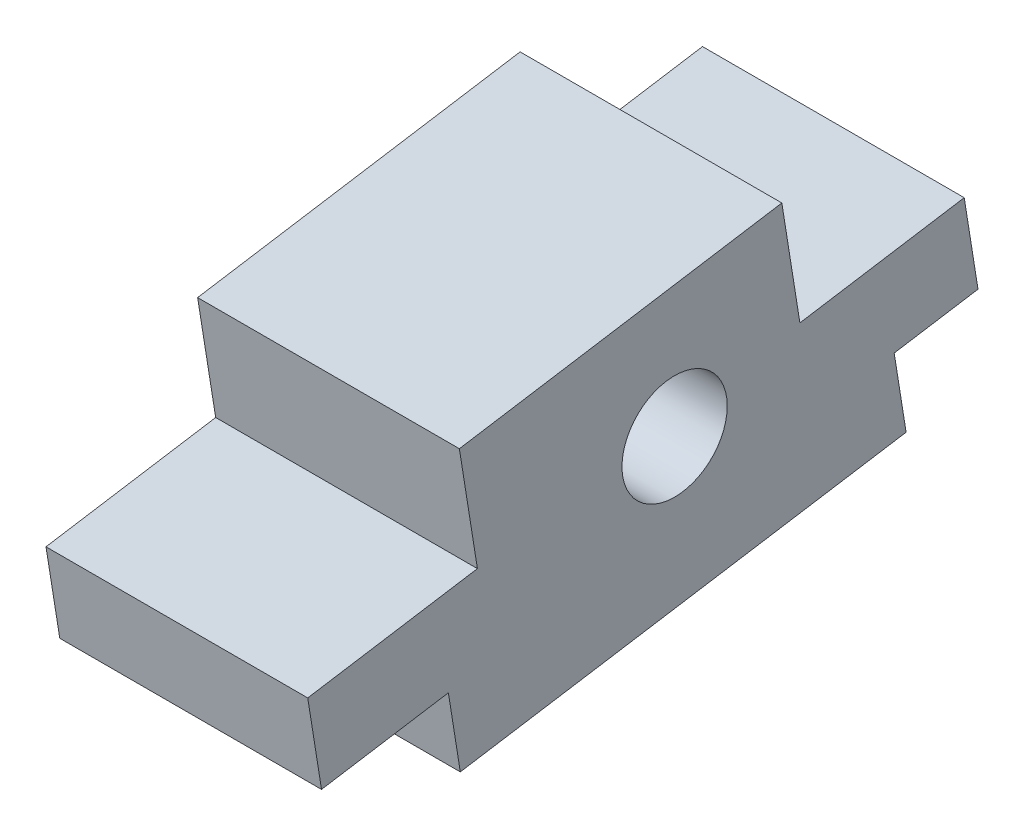
ISO-10303-21;
HEADER;
FILE_DESCRIPTION(('STEP AP214'),'2;1');
FILE_NAME('part.step','',(''),(''),'','','');
FILE_SCHEMA(('AUTOMOTIVE_DESIGN { 1 0 10303 214 1 1 1 1 }'));
ENDSEC;
DATA;
#1=APPLICATION_CONTEXT('core data for automotive mechanical design processes');
#2=APPLICATION_PROTOCOL_DEFINITION('international standard','automotive_design',2000,#1);
#3=PRODUCT_CONTEXT('',#1,'mechanical');
#4=PRODUCT('Part','Part','',(#3));
#5=PRODUCT_RELATED_PRODUCT_CATEGORY('part','',(#4));
#6=PRODUCT_DEFINITION_FORMATION('','',#4);
#7=PRODUCT_DEFINITION_CONTEXT('part definition',#1,'design');
#8=PRODUCT_DEFINITION('design','',#6,#7);
#9=PRODUCT_DEFINITION_SHAPE('','',#8);
#10=(LENGTH_UNIT() NAMED_UNIT(*) SI_UNIT(.MILLI.,.METRE.));
#11=(NAMED_UNIT(*) PLANE_ANGLE_UNIT() SI_UNIT($,.RADIAN.));
#12=(NAMED_UNIT(*) SI_UNIT($,.STERADIAN.) SOLID_ANGLE_UNIT());
#13=UNCERTAINTY_MEASURE_WITH_UNIT(LENGTH_MEASURE(1.E-05),#10,'distance_accuracy_value','');
#14=(GEOMETRIC_REPRESENTATION_CONTEXT(3) GLOBAL_UNCERTAINTY_ASSIGNED_CONTEXT((#13)) GLOBAL_UNIT_ASSIGNED_CONTEXT((#10,
#11,#12)) REPRESENTATION_CONTEXT('',''));
#15=CARTESIAN_POINT('',(0.,0.,0.));
#16=DIRECTION('',(0.,0.,1.));
#17=DIRECTION('',(1.,0.,0.));
#18=AXIS2_PLACEMENT_3D('',#15,#16,#17);
#19=CARTESIAN_POINT('',(30.,0.,0.));
#20=DIRECTION('',(-1.,0.,0.));
#21=DIRECTION('',(0.,0.,1.));
#22=AXIS2_PLACEMENT_3D('',#19,#20,#21);
#23=PLANE('',#22);
#24=DIRECTION('',(0.,0.157884428051549,-0.987457597762474));
#25=VECTOR('',#24,1.);
#26=CARTESIAN_POINT('',(30.,-12.4833012393773,25.9308376280646));
#27=LINE('',#26,#25);
#28=CARTESIAN_POINT('',(30.,-14.8081494424364,40.471150755117));
#29=VERTEX_POINT('',#28);
#30=CARTESIAN_POINT('',(30.,-12.4833012393773,25.9308376280646));
#31=VERTEX_POINT('',#30);
#32=EDGE_CURVE('E204',#29,#31,#27,.T.);
#33=ORIENTED_EDGE('',*,*,#32,.T.);
#34=DIRECTION('',(0.,-0.987457597762473,-0.15788442805155));
#35=VECTOR('',#34,1.);
#36=CARTESIAN_POINT('',(30.,-21.022754011026,24.5654659708106));
#37=LINE('',#36,#35);
#38=CARTESIAN_POINT('',(30.,-21.022754011026,24.5654659708106));
#39=VERTEX_POINT('',#38);
#40=EDGE_CURVE('E116',#31,#39,#37,.T.);
#41=ORIENTED_EDGE('',*,*,#40,.T.);
#42=DIRECTION('',(0.,0.15788442805155,-0.987457597762474));
#43=VECTOR('',#42,1.);
#44=CARTESIAN_POINT('',(30.,-12.8526712661271,-26.532735291726));
#45=LINE('',#44,#43);
#46=CARTESIAN_POINT('',(30.,-12.8526712661271,-26.532735291726));
#47=VERTEX_POINT('',#46);
#48=EDGE_CURVE('E241',#39,#47,#45,.T.);
#49=ORIENTED_EDGE('',*,*,#48,.T.);
#50=DIRECTION('',(0.,0.987457597762474,0.157884428051547));
#51=VECTOR('',#50,1.);
#52=CARTESIAN_POINT('',(30.,-4.3132184944783,-25.167363634472));
#53=LINE('',#52,#51);
#54=CARTESIAN_POINT('',(30.,-4.3132184944783,-25.167363634472));
#55=VERTEX_POINT('',#54);
#56=EDGE_CURVE('E261',#47,#55,#53,.T.);
#57=ORIENTED_EDGE('',*,*,#56,.T.);
#58=DIRECTION('',(0.,0.157884428051547,-0.987457597762474));
#59=VECTOR('',#58,1.);
#60=CARTESIAN_POINT('',(30.,-2.77735602490824,-34.7731181943837));
#61=LINE('',#60,#59);
#62=CARTESIAN_POINT('',(30.,-2.77735602490824,-34.7731181943837));
#63=VERTEX_POINT('',#62);
#64=EDGE_CURVE('E257',#55,#63,#61,.T.);
#65=ORIENTED_EDGE('',*,*,#64,.T.);
#66=DIRECTION('',(0.,0.987457597762474,0.157884428051547));
#67=VECTOR('',#66,1.);
#68=CARTESIAN_POINT('',(30.,7.0972199527165,-33.1942739138682));
#69=LINE('',#68,#67);
#70=CARTESIAN_POINT('',(30.,7.0972199527165,-33.1942739138682));
#71=VERTEX_POINT('',#70);
#72=EDGE_CURVE('E260',#63,#71,#69,.T.);
#73=ORIENTED_EDGE('',*,*,#72,.T.);
#74=DIRECTION('',(0.,-0.157884428051548,0.987457597762474));
#75=VECTOR('',#74,1.);
#76=CARTESIAN_POINT('',(30.,4.08569762502307,-14.3592903755214));
#77=LINE('',#76,#75);
#78=CARTESIAN_POINT('',(30.,4.08569762502307,-14.3592903755214));
#79=VERTEX_POINT('',#78);
#80=EDGE_CURVE('E265',#71,#79,#77,.T.);
#81=ORIENTED_EDGE('',*,*,#80,.T.);
#82=DIRECTION('',(0.,0.987457597762474,0.157884428051546));
#83=VECTOR('',#82,1.);
#84=CARTESIAN_POINT('',(30.,17.023447604708,-12.2906757226543));
#85=LINE('',#84,#83);
#86=CARTESIAN_POINT('',(30.,17.023447604708,-12.2906757226543));
#87=VERTEX_POINT('',#86);
#88=EDGE_CURVE('E272',#79,#87,#85,.T.);
#89=ORIENTED_EDGE('',*,*,#88,.T.);
#90=DIRECTION('',(0.,-0.157884428051548,0.987457597762474));
#91=VECTOR('',#90,1.);
#92=CARTESIAN_POINT('',(30.,11.1135891865311,24.6713899398569));
#93=LINE('',#92,#91);
#94=CARTESIAN_POINT('',(30.,11.1135891865311,24.6713899398569));
#95=VERTEX_POINT('',#94);
#96=EDGE_CURVE('E147',#87,#95,#93,.T.);
#97=ORIENTED_EDGE('',*,*,#96,.T.);
#98=DIRECTION('',(0.,-0.987457597762474,-0.157884428051549));
#99=VECTOR('',#98,1.);
#100=CARTESIAN_POINT('',(30.,-1.824160793154,22.6027752869897));
#101=LINE('',#100,#99);
#102=CARTESIAN_POINT('',(30.,-1.824160793154,22.6027752869897));
#103=VERTEX_POINT('',#102);
#104=EDGE_CURVE('E141',#95,#103,#101,.T.);
#105=ORIENTED_EDGE('',*,*,#104,.T.);
#106=DIRECTION('',(0.,-0.157884428051548,0.987457597762474));
#107=VECTOR('',#106,1.);
#108=CARTESIAN_POINT('',(30.,-4.93357346481162,42.0499950356325));
#109=LINE('',#108,#107);
#110=CARTESIAN_POINT('',(30.,-4.93357346481162,42.0499950356325));
#111=VERTEX_POINT('',#110);
#112=EDGE_CURVE('E145',#103,#111,#109,.T.);
#113=ORIENTED_EDGE('',*,*,#112,.T.);
#114=DIRECTION('',(0.,-0.987457597762474,-0.157884428051547));
#115=VECTOR('',#114,1.);
#116=CARTESIAN_POINT('',(30.,-14.8081494424364,40.471150755117));
#117=LINE('',#116,#115);
#118=EDGE_CURVE('E61',#111,#29,#117,.T.);
#119=ORIENTED_EDGE('',*,*,#118,.T.);
#120=EDGE_LOOP('',(#33,#41,#49,#57,#65,#73,#81,#89,#97,#105,#113,#119));
#121=FACE_BOUND('',#120,.T.);
#122=CARTESIAN_POINT('',(30.,0.,0.));
#123=DIRECTION('',(1.,0.,0.));
#124=DIRECTION('',(0.,0.,-1.));
#125=AXIS2_PLACEMENT_3D('',#122,#123,#124);
#126=CIRCLE('',#125,6.03249999999993);
#127=CARTESIAN_POINT('',(30.,0.,-6.03249999999993));
#128=VERTEX_POINT('',#127);
#129=EDGE_CURVE('E174',#128,#128,#126,.T.);
#130=ORIENTED_EDGE('',*,*,#129,.F.);
#131=EDGE_LOOP('',(#130));
#132=FACE_BOUND('',#131,.T.);
#133=ADVANCED_FACE('F43',(#121,#132),#23,.F.);
#134=CARTESIAN_POINT('',(0.,0.,0.));
#135=DIRECTION('',(-1.,0.,0.));
#136=DIRECTION('',(0.,0.,1.));
#137=AXIS2_PLACEMENT_3D('',#134,#135,#136);
#138=PLANE('',#137);
#139=DIRECTION('',(0.,0.157884428051549,-0.987457597762474));
#140=VECTOR('',#139,1.);
#141=CARTESIAN_POINT('',(0.,-12.4833012393773,25.9308376280646));
#142=LINE('',#141,#140);
#143=CARTESIAN_POINT('',(0.,-14.8081494424364,40.471150755117));
#144=VERTEX_POINT('',#143);
#145=CARTESIAN_POINT('',(0.,-12.4833012393773,25.9308376280646));
#146=VERTEX_POINT('',#145);
#147=EDGE_CURVE('E169',#144,#146,#142,.T.);
#148=ORIENTED_EDGE('',*,*,#147,.F.);
#149=DIRECTION('',(0.,-0.987457597762474,-0.157884428051547));
#150=VECTOR('',#149,1.);
#151=CARTESIAN_POINT('',(0.,-14.8081494424364,40.471150755117));
#152=LINE('',#151,#150);
#153=CARTESIAN_POINT('',(0.,-4.93357346481162,42.0499950356325));
#154=VERTEX_POINT('',#153);
#155=EDGE_CURVE('E108',#154,#144,#152,.T.);
#156=ORIENTED_EDGE('',*,*,#155,.F.);
#157=DIRECTION('',(0.,-0.157884428051548,0.987457597762474));
#158=VECTOR('',#157,1.);
#159=CARTESIAN_POINT('',(0.,-4.93357346481162,42.0499950356325));
#160=LINE('',#159,#158);
#161=CARTESIAN_POINT('',(0.,-1.824160793154,22.6027752869897));
#162=VERTEX_POINT('',#161);
#163=EDGE_CURVE('E102',#162,#154,#160,.T.);
#164=ORIENTED_EDGE('',*,*,#163,.F.);
#165=DIRECTION('',(0.,-0.987457597762474,-0.157884428051549));
#166=VECTOR('',#165,1.);
#167=CARTESIAN_POINT('',(0.,-1.824160793154,22.6027752869897));
#168=LINE('',#167,#166);
#169=CARTESIAN_POINT('',(0.,11.1135891865311,24.6713899398569));
#170=VERTEX_POINT('',#169);
#171=EDGE_CURVE('E156',#170,#162,#168,.T.);
#172=ORIENTED_EDGE('',*,*,#171,.F.);
#173=DIRECTION('',(0.,-0.157884428051548,0.987457597762474));
#174=VECTOR('',#173,1.);
#175=CARTESIAN_POINT('',(0.,11.1135891865311,24.6713899398569));
#176=LINE('',#175,#174);
#177=CARTESIAN_POINT('',(0.,17.023447604708,-12.2906757226543));
#178=VERTEX_POINT('',#177);
#179=EDGE_CURVE('E195',#178,#170,#176,.T.);
#180=ORIENTED_EDGE('',*,*,#179,.F.);
#181=DIRECTION('',(0.,0.987457597762474,0.157884428051546));
#182=VECTOR('',#181,1.);
#183=CARTESIAN_POINT('',(0.,17.023447604708,-12.2906757226543));
#184=LINE('',#183,#182);
#185=CARTESIAN_POINT('',(0.,4.08569762502307,-14.3592903755214));
#186=VERTEX_POINT('',#185);
#187=EDGE_CURVE('E192',#186,#178,#184,.T.);
#188=ORIENTED_EDGE('',*,*,#187,.F.);
#189=DIRECTION('',(0.,-0.157884428051548,0.987457597762474));
#190=VECTOR('',#189,1.);
#191=CARTESIAN_POINT('',(0.,4.08569762502307,-14.3592903755214));
#192=LINE('',#191,#190);
#193=CARTESIAN_POINT('',(0.,7.0972199527165,-33.1942739138682));
#194=VERTEX_POINT('',#193);
#195=EDGE_CURVE('E189',#194,#186,#192,.T.);
#196=ORIENTED_EDGE('',*,*,#195,.F.);
#197=DIRECTION('',(0.,0.987457597762474,0.157884428051547));
#198=VECTOR('',#197,1.);
#199=CARTESIAN_POINT('',(0.,7.0972199527165,-33.1942739138682));
#200=LINE('',#199,#198);
#201=CARTESIAN_POINT('',(0.,-2.77735602490824,-34.7731181943837));
#202=VERTEX_POINT('',#201);
#203=EDGE_CURVE('E186',#202,#194,#200,.T.);
#204=ORIENTED_EDGE('',*,*,#203,.F.);
#205=DIRECTION('',(0.,0.157884428051547,-0.987457597762474));
#206=VECTOR('',#205,1.);
#207=CARTESIAN_POINT('',(0.,-2.77735602490824,-34.7731181943837));
#208=LINE('',#207,#206);
#209=CARTESIAN_POINT('',(0.,-4.3132184944783,-25.167363634472));
#210=VERTEX_POINT('',#209);
#211=EDGE_CURVE('E183',#210,#202,#208,.T.);
#212=ORIENTED_EDGE('',*,*,#211,.F.);
#213=DIRECTION('',(0.,0.987457597762474,0.157884428051547));
#214=VECTOR('',#213,1.);
#215=CARTESIAN_POINT('',(0.,-4.3132184944783,-25.167363634472));
#216=LINE('',#215,#214);
#217=CARTESIAN_POINT('',(0.,-12.8526712661271,-26.532735291726));
#218=VERTEX_POINT('',#217);
#219=EDGE_CURVE('E180',#218,#210,#216,.T.);
#220=ORIENTED_EDGE('',*,*,#219,.F.);
#221=DIRECTION('',(0.,0.15788442805155,-0.987457597762474));
#222=VECTOR('',#221,1.);
#223=CARTESIAN_POINT('',(0.,-12.8526712661271,-26.532735291726));
#224=LINE('',#223,#222);
#225=CARTESIAN_POINT('',(0.,-21.022754011026,24.5654659708106));
#226=VERTEX_POINT('',#225);
#227=EDGE_CURVE('E177',#226,#218,#224,.T.);
#228=ORIENTED_EDGE('',*,*,#227,.F.);
#229=DIRECTION('',(0.,-0.987457597762473,-0.15788442805155));
#230=VECTOR('',#229,1.);
#231=CARTESIAN_POINT('',(0.,-21.022754011026,24.5654659708106));
#232=LINE('',#231,#230);
#233=EDGE_CURVE('E173',#146,#226,#232,.T.);
#234=ORIENTED_EDGE('',*,*,#233,.F.);
#235=EDGE_LOOP('',(#148,#156,#164,#172,#180,#188,#196,#204,#212,#220,#228,#234));
#236=FACE_BOUND('',#235,.T.);
#237=CARTESIAN_POINT('',(0.,0.,0.));
#238=DIRECTION('',(1.,0.,0.));
#239=DIRECTION('',(0.,0.,-1.));
#240=AXIS2_PLACEMENT_3D('',#237,#238,#239);
#241=CIRCLE('',#240,6.03249999999993);
#242=CARTESIAN_POINT('',(0.,0.,-6.03249999999993));
#243=VERTEX_POINT('',#242);
#244=EDGE_CURVE('E451',#243,#243,#241,.T.);
#245=ORIENTED_EDGE('',*,*,#244,.T.);
#246=EDGE_LOOP('',(#245));
#247=FACE_BOUND('',#246,.T.);
#248=ADVANCED_FACE('F245',(#236,#247),#138,.T.);
#249=CARTESIAN_POINT('',(30.,-12.4833012393773,25.9308376280646));
#250=DIRECTION('',(0.,0.987457597762474,0.157884428051549));
#251=DIRECTION('',(0.,-0.157884428051549,0.987457597762474));
#252=AXIS2_PLACEMENT_3D('',#249,#250,#251);
#253=PLANE('',#252);
#254=ORIENTED_EDGE('',*,*,#147,.T.);
#255=DIRECTION('',(-1.,0.,0.));
#256=VECTOR('',#255,1.);
#257=CARTESIAN_POINT('',(30.,-12.4833012393773,25.9308376280646));
#258=LINE('',#257,#256);
#259=EDGE_CURVE('E11',#31,#146,#258,.T.);
#260=ORIENTED_EDGE('',*,*,#259,.F.);
#261=ORIENTED_EDGE('',*,*,#32,.F.);
#262=DIRECTION('',(-1.,0.,0.));
#263=VECTOR('',#262,1.);
#264=CARTESIAN_POINT('',(30.,-14.8081494424364,40.471150755117));
#265=LINE('',#264,#263);
#266=EDGE_CURVE('E165',#29,#144,#265,.T.);
#267=ORIENTED_EDGE('',*,*,#266,.T.);
#268=EDGE_LOOP('',(#254,#260,#261,#267));
#269=FACE_BOUND('',#268,.T.);
#270=ADVANCED_FACE('F45',(#269),#253,.F.);
#271=CARTESIAN_POINT('',(30.,-21.022754011026,24.5654659708106));
#272=DIRECTION('',(0.,0.15788442805155,-0.987457597762473));
#273=DIRECTION('',(0.,0.987457597762474,0.15788442805155));
#274=AXIS2_PLACEMENT_3D('',#271,#272,#273);
#275=PLANE('',#274);
#276=ORIENTED_EDGE('',*,*,#233,.T.);
#277=DIRECTION('',(-1.,0.,0.));
#278=VECTOR('',#277,1.);
#279=CARTESIAN_POINT('',(30.,-21.022754011026,24.5654659708106));
#280=LINE('',#279,#278);
#281=EDGE_CURVE('E53',#39,#226,#280,.T.);
#282=ORIENTED_EDGE('',*,*,#281,.F.);
#283=ORIENTED_EDGE('',*,*,#40,.F.);
#284=ORIENTED_EDGE('',*,*,#259,.T.);
#285=EDGE_LOOP('',(#276,#282,#283,#284));
#286=FACE_BOUND('',#285,.T.);
#287=ADVANCED_FACE('F308',(#286),#275,.F.);
#288=CARTESIAN_POINT('',(30.,-12.8526712661271,-26.532735291726));
#289=DIRECTION('',(0.,0.987457597762474,0.15788442805155));
#290=DIRECTION('',(0.,-0.15788442805155,0.987457597762474));
#291=AXIS2_PLACEMENT_3D('',#288,#289,#290);
#292=PLANE('',#291);
#293=ORIENTED_EDGE('',*,*,#227,.T.);
#294=DIRECTION('',(-1.,0.,0.));
#295=VECTOR('',#294,1.);
#296=CARTESIAN_POINT('',(30.,-12.8526712661271,-26.532735291726));
#297=LINE('',#296,#295);
#298=EDGE_CURVE('E231',#47,#218,#297,.T.);
#299=ORIENTED_EDGE('',*,*,#298,.F.);
#300=ORIENTED_EDGE('',*,*,#48,.F.);
#301=ORIENTED_EDGE('',*,*,#281,.T.);
#302=EDGE_LOOP('',(#293,#299,#300,#301));
#303=FACE_BOUND('',#302,.T.);
#304=ADVANCED_FACE('F239',(#303),#292,.F.);
#305=CARTESIAN_POINT('',(30.,-4.3132184944783,-25.167363634472));
#306=DIRECTION('',(0.,-0.157884428051547,0.987457597762474));
#307=DIRECTION('',(0.,-0.987457597762474,-0.157884428051547));
#308=AXIS2_PLACEMENT_3D('',#305,#306,#307);
#309=PLANE('',#308);
#310=ORIENTED_EDGE('',*,*,#219,.T.);
#311=DIRECTION('',(-1.,0.,0.));
#312=VECTOR('',#311,1.);
#313=CARTESIAN_POINT('',(30.,-4.3132184944783,-25.167363634472));
#314=LINE('',#313,#312);
#315=EDGE_CURVE('E227',#55,#210,#314,.T.);
#316=ORIENTED_EDGE('',*,*,#315,.F.);
#317=ORIENTED_EDGE('',*,*,#56,.F.);
#318=ORIENTED_EDGE('',*,*,#298,.T.);
#319=EDGE_LOOP('',(#310,#316,#317,#318));
#320=FACE_BOUND('',#319,.T.);
#321=ADVANCED_FACE('F251',(#320),#309,.F.);
#322=CARTESIAN_POINT('',(30.,-2.77735602490824,-34.7731181943837));
#323=DIRECTION('',(0.,0.987457597762474,0.157884428051547));
#324=DIRECTION('',(0.,-0.157884428051547,0.987457597762474));
#325=AXIS2_PLACEMENT_3D('',#322,#323,#324);
#326=PLANE('',#325);
#327=ORIENTED_EDGE('',*,*,#211,.T.);
#328=DIRECTION('',(-1.,0.,0.));
#329=VECTOR('',#328,1.);
#330=CARTESIAN_POINT('',(30.,-2.77735602490824,-34.7731181943837));
#331=LINE('',#330,#329);
#332=EDGE_CURVE('E223',#63,#202,#331,.T.);
#333=ORIENTED_EDGE('',*,*,#332,.F.);
#334=ORIENTED_EDGE('',*,*,#64,.F.);
#335=ORIENTED_EDGE('',*,*,#315,.T.);
#336=EDGE_LOOP('',(#327,#333,#334,#335));
#337=FACE_BOUND('',#336,.T.);
#338=ADVANCED_FACE('F255',(#337),#326,.F.);
#339=CARTESIAN_POINT('',(30.,7.0972199527165,-33.1942739138682));
#340=DIRECTION('',(0.,-0.157884428051547,0.987457597762474));
#341=DIRECTION('',(0.,-0.987457597762474,-0.157884428051547));
#342=AXIS2_PLACEMENT_3D('',#339,#340,#341);
#343=PLANE('',#342);
#344=ORIENTED_EDGE('',*,*,#203,.T.);
#345=DIRECTION('',(-1.,0.,0.));
#346=VECTOR('',#345,1.);
#347=CARTESIAN_POINT('',(30.,7.0972199527165,-33.1942739138682));
#348=LINE('',#347,#346);
#349=EDGE_CURVE('E219',#71,#194,#348,.T.);
#350=ORIENTED_EDGE('',*,*,#349,.F.);
#351=ORIENTED_EDGE('',*,*,#72,.F.);
#352=ORIENTED_EDGE('',*,*,#332,.T.);
#353=EDGE_LOOP('',(#344,#350,#351,#352));
#354=FACE_BOUND('',#353,.T.);
#355=ADVANCED_FACE('F321',(#354),#343,.F.);
#356=CARTESIAN_POINT('',(30.,4.08569762502307,-14.3592903755214));
#357=DIRECTION('',(0.,-0.987457597762474,-0.157884428051548));
#358=DIRECTION('',(0.,0.157884428051548,-0.987457597762474));
#359=AXIS2_PLACEMENT_3D('',#356,#357,#358);
#360=PLANE('',#359);
#361=ORIENTED_EDGE('',*,*,#195,.T.);
#362=DIRECTION('',(-1.,0.,0.));
#363=VECTOR('',#362,1.);
#364=CARTESIAN_POINT('',(30.,4.08569762502307,-14.3592903755214));
#365=LINE('',#364,#363);
#366=EDGE_CURVE('E215',#79,#186,#365,.T.);
#367=ORIENTED_EDGE('',*,*,#366,.F.);
#368=ORIENTED_EDGE('',*,*,#80,.F.);
#369=ORIENTED_EDGE('',*,*,#349,.T.);
#370=EDGE_LOOP('',(#361,#367,#368,#369));
#371=FACE_BOUND('',#370,.T.);
#372=ADVANCED_FACE('F324',(#371),#360,.F.);
#373=CARTESIAN_POINT('',(30.,17.023447604708,-12.2906757226543));
#374=DIRECTION('',(0.,-0.157884428051546,0.987457597762474));
#375=DIRECTION('',(0.,-0.987457597762474,-0.157884428051546));
#376=AXIS2_PLACEMENT_3D('',#373,#374,#375);
#377=PLANE('',#376);
#378=ORIENTED_EDGE('',*,*,#187,.T.);
#379=DIRECTION('',(-1.,0.,0.));
#380=VECTOR('',#379,1.);
#381=CARTESIAN_POINT('',(30.,17.023447604708,-12.2906757226543));
#382=LINE('',#381,#380);
#383=EDGE_CURVE('E211',#87,#178,#382,.T.);
#384=ORIENTED_EDGE('',*,*,#383,.F.);
#385=ORIENTED_EDGE('',*,*,#88,.F.);
#386=ORIENTED_EDGE('',*,*,#366,.T.);
#387=EDGE_LOOP('',(#378,#384,#385,#386));
#388=FACE_BOUND('',#387,.T.);
#389=ADVANCED_FACE('F280',(#388),#377,.F.);
#390=CARTESIAN_POINT('',(30.,11.1135891865311,24.6713899398569));
#391=DIRECTION('',(0.,-0.987457597762474,-0.157884428051548));
#392=DIRECTION('',(0.,0.157884428051548,-0.987457597762474));
#393=AXIS2_PLACEMENT_3D('',#390,#391,#392);
#394=PLANE('',#393);
#395=ORIENTED_EDGE('',*,*,#179,.T.);
#396=DIRECTION('',(-1.,0.,0.));
#397=VECTOR('',#396,1.);
#398=CARTESIAN_POINT('',(30.,11.1135891865311,24.6713899398569));
#399=LINE('',#398,#397);
#400=EDGE_CURVE('E158',#95,#170,#399,.T.);
#401=ORIENTED_EDGE('',*,*,#400,.F.);
#402=ORIENTED_EDGE('',*,*,#96,.F.);
#403=ORIENTED_EDGE('',*,*,#383,.T.);
#404=EDGE_LOOP('',(#395,#401,#402,#403));
#405=FACE_BOUND('',#404,.T.);
#406=ADVANCED_FACE('F284',(#405),#394,.F.);
#407=CARTESIAN_POINT('',(30.,-1.824160793154,22.6027752869897));
#408=DIRECTION('',(0.,0.157884428051549,-0.987457597762474));
#409=DIRECTION('',(0.,0.987457597762474,0.157884428051549));
#410=AXIS2_PLACEMENT_3D('',#407,#408,#409);
#411=PLANE('',#410);
#412=ORIENTED_EDGE('',*,*,#171,.T.);
#413=DIRECTION('',(-1.,0.,0.));
#414=VECTOR('',#413,1.);
#415=CARTESIAN_POINT('',(30.,-1.824160793154,22.6027752869897));
#416=LINE('',#415,#414);
#417=EDGE_CURVE('E153',#103,#162,#416,.T.);
#418=ORIENTED_EDGE('',*,*,#417,.F.);
#419=ORIENTED_EDGE('',*,*,#104,.F.);
#420=ORIENTED_EDGE('',*,*,#400,.T.);
#421=EDGE_LOOP('',(#412,#418,#419,#420));
#422=FACE_BOUND('',#421,.T.);
#423=ADVANCED_FACE('F154',(#422),#411,.F.);
#424=CARTESIAN_POINT('',(30.,-4.93357346481162,42.0499950356325));
#425=DIRECTION('',(0.,-0.987457597762474,-0.157884428051548));
#426=DIRECTION('',(0.,0.157884428051548,-0.987457597762474));
#427=AXIS2_PLACEMENT_3D('',#424,#425,#426);
#428=PLANE('',#427);
#429=ORIENTED_EDGE('',*,*,#163,.T.);
#430=DIRECTION('',(-1.,0.,0.));
#431=VECTOR('',#430,1.);
#432=CARTESIAN_POINT('',(30.,-4.93357346481162,42.0499950356325));
#433=LINE('',#432,#431);
#434=EDGE_CURVE('E159',#111,#154,#433,.T.);
#435=ORIENTED_EDGE('',*,*,#434,.F.);
#436=ORIENTED_EDGE('',*,*,#112,.F.);
#437=ORIENTED_EDGE('',*,*,#417,.T.);
#438=EDGE_LOOP('',(#429,#435,#436,#437));
#439=FACE_BOUND('',#438,.T.);
#440=ADVANCED_FACE('F161',(#439),#428,.F.);
#441=CARTESIAN_POINT('',(30.,-14.8081494424364,40.471150755117));
#442=DIRECTION('',(0.,0.157884428051547,-0.987457597762474));
#443=DIRECTION('',(0.,0.987457597762474,0.157884428051547));
#444=AXIS2_PLACEMENT_3D('',#441,#442,#443);
#445=PLANE('',#444);
#446=ORIENTED_EDGE('',*,*,#155,.T.);
#447=ORIENTED_EDGE('',*,*,#266,.F.);
#448=ORIENTED_EDGE('',*,*,#118,.F.);
#449=ORIENTED_EDGE('',*,*,#434,.T.);
#450=EDGE_LOOP('',(#446,#447,#448,#449));
#451=FACE_BOUND('',#450,.T.);
#452=ADVANCED_FACE('F288',(#451),#445,.F.);
#453=CARTESIAN_POINT('',(30.,0.,0.));
#454=DIRECTION('',(-1.,0.,0.));
#455=DIRECTION('',(0.,0.,1.));
#456=AXIS2_PLACEMENT_3D('',#453,#454,#455);
#457=CYLINDRICAL_SURFACE('',#456,6.03249999999993);
#458=ORIENTED_EDGE('',*,*,#129,.T.);
#459=EDGE_LOOP('',(#458));
#460=FACE_BOUND('',#459,.T.);
#461=ORIENTED_EDGE('',*,*,#244,.F.);
#462=EDGE_LOOP('',(#461));
#463=FACE_BOUND('',#462,.T.);
#464=ADVANCED_FACE('F290',(#460,#463),#457,.F.);
#465=CLOSED_SHELL('',(#133,#248,#270,#287,#304,#321,#338,#355,#372,#389,#406,#423,#440,#452,#464));
#466=MANIFOLD_SOLID_BREP('B2',#465);
#467=ADVANCED_BREP_SHAPE_REPRESENTATION('',(#18,#466),#14);
#468=SHAPE_DEFINITION_REPRESENTATION(#9,#467);
ENDSEC;
END-ISO-10303-21;
